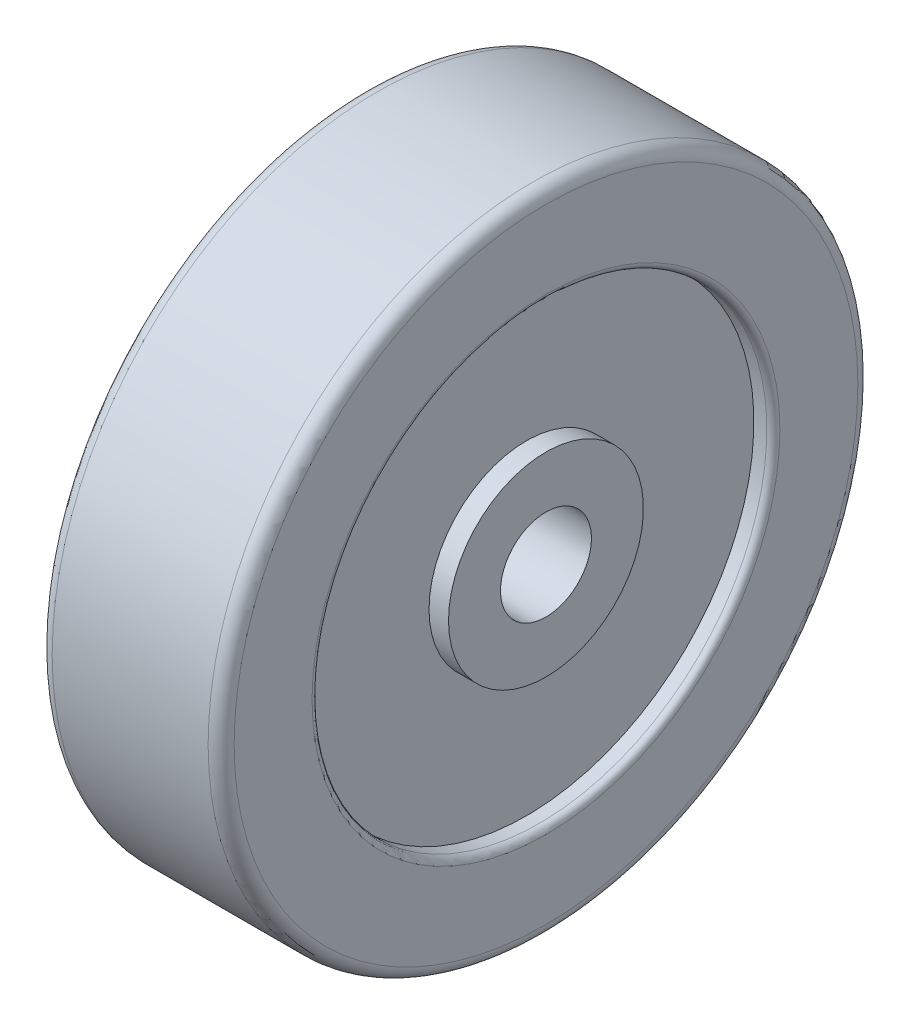
ISO-10303-21;
HEADER;
FILE_DESCRIPTION(('STEP AP214'),'2;1');
FILE_NAME('part.step','',(''),(''),'','','');
FILE_SCHEMA(('AUTOMOTIVE_DESIGN { 1 0 10303 214 1 1 1 1 }'));
ENDSEC;
DATA;
#1=APPLICATION_CONTEXT('core data for automotive mechanical design processes');
#2=APPLICATION_PROTOCOL_DEFINITION('international standard','automotive_design',2000,#1);
#3=PRODUCT_CONTEXT('',#1,'mechanical');
#4=PRODUCT('Part','Part','',(#3));
#5=PRODUCT_RELATED_PRODUCT_CATEGORY('part','',(#4));
#6=PRODUCT_DEFINITION_FORMATION('','',#4);
#7=PRODUCT_DEFINITION_CONTEXT('part definition',#1,'design');
#8=PRODUCT_DEFINITION('design','',#6,#7);
#9=PRODUCT_DEFINITION_SHAPE('','',#8);
#10=(LENGTH_UNIT() NAMED_UNIT(*) SI_UNIT(.MILLI.,.METRE.));
#11=(NAMED_UNIT(*) PLANE_ANGLE_UNIT() SI_UNIT($,.RADIAN.));
#12=(NAMED_UNIT(*) SI_UNIT($,.STERADIAN.) SOLID_ANGLE_UNIT());
#13=UNCERTAINTY_MEASURE_WITH_UNIT(LENGTH_MEASURE(1.E-05),#10,'distance_accuracy_value','');
#14=(GEOMETRIC_REPRESENTATION_CONTEXT(3) GLOBAL_UNCERTAINTY_ASSIGNED_CONTEXT((#13)) GLOBAL_UNIT_ASSIGNED_CONTEXT((#10,
#11,#12)) REPRESENTATION_CONTEXT('',''));
#15=CARTESIAN_POINT('',(0.,0.,0.));
#16=DIRECTION('',(0.,0.,1.));
#17=DIRECTION('',(1.,0.,0.));
#18=AXIS2_PLACEMENT_3D('',#15,#16,#17);
#19=CARTESIAN_POINT('',(-12.6497087523557,8.,0.));
#20=DIRECTION('',(1.,0.,0.));
#21=DIRECTION('',(0.,0.,-1.));
#22=AXIS2_PLACEMENT_3D('',#19,#20,#21);
#23=PLANE('',#22);
#24=CARTESIAN_POINT('',(-12.6497087523557,-7.,0.));
#25=DIRECTION('',(-1.,0.,0.));
#26=DIRECTION('',(0.,0.,1.));
#27=AXIS2_PLACEMENT_3D('',#24,#25,#26);
#28=CIRCLE('',#27,7.);
#29=CARTESIAN_POINT('',(-12.6497087523557,-7.,7.));
#30=VERTEX_POINT('',#29);
#31=EDGE_CURVE('E63',#30,#30,#28,.T.);
#32=ORIENTED_EDGE('',*,*,#31,.F.);
#33=EDGE_LOOP('',(#32));
#34=FACE_BOUND('',#33,.T.);
#35=CARTESIAN_POINT('',(-12.6497087523557,-7.,0.));
#36=DIRECTION('',(-1.,0.,0.));
#37=DIRECTION('',(0.,0.,1.));
#38=AXIS2_PLACEMENT_3D('',#35,#36,#37);
#39=CIRCLE('',#38,15.);
#40=CARTESIAN_POINT('',(-12.6497087523557,-7.,15.));
#41=VERTEX_POINT('',#40);
#42=EDGE_CURVE('E84',#41,#41,#39,.T.);
#43=ORIENTED_EDGE('',*,*,#42,.T.);
#44=EDGE_LOOP('',(#43));
#45=FACE_BOUND('',#44,.T.);
#46=ADVANCED_FACE('F31',(#34,#45),#23,.F.);
#47=CARTESIAN_POINT('',(-30.1636657433056,-7.,0.));
#48=DIRECTION('',(-1.,0.,0.));
#49=DIRECTION('',(0.,0.,1.));
#50=AXIS2_PLACEMENT_3D('',#47,#48,#49);
#51=CYLINDRICAL_SURFACE('',#50,7.);
#52=CARTESIAN_POINT('',(15.3502912476443,-7.,0.));
#53=DIRECTION('',(-1.,0.,0.));
#54=DIRECTION('',(0.,0.,1.));
#55=AXIS2_PLACEMENT_3D('',#52,#53,#54);
#56=CIRCLE('',#55,7.);
#57=CARTESIAN_POINT('',(15.3502912476443,-7.,7.));
#58=VERTEX_POINT('',#57);
#59=EDGE_CURVE('E66',#58,#58,#56,.T.);
#60=ORIENTED_EDGE('',*,*,#59,.F.);
#61=EDGE_LOOP('',(#60));
#62=FACE_BOUND('',#61,.T.);
#63=ORIENTED_EDGE('',*,*,#31,.T.);
#64=EDGE_LOOP('',(#63));
#65=FACE_BOUND('',#64,.T.);
#66=ADVANCED_FACE('F114',(#62,#65),#51,.F.);
#67=CARTESIAN_POINT('',(15.3502912476443,0.,0.));
#68=DIRECTION('',(-1.,0.,0.));
#69=DIRECTION('',(0.,0.,1.));
#70=AXIS2_PLACEMENT_3D('',#67,#68,#69);
#71=PLANE('',#70);
#72=CARTESIAN_POINT('',(15.3502912476443,-7.,0.));
#73=DIRECTION('',(-1.,0.,0.));
#74=DIRECTION('',(0.,0.,1.));
#75=AXIS2_PLACEMENT_3D('',#72,#73,#74);
#76=CIRCLE('',#75,15.);
#77=CARTESIAN_POINT('',(15.3502912476443,-7.,15.));
#78=VERTEX_POINT('',#77);
#79=EDGE_CURVE('E69',#78,#78,#76,.T.);
#80=ORIENTED_EDGE('',*,*,#79,.F.);
#81=EDGE_LOOP('',(#80));
#82=FACE_BOUND('',#81,.T.);
#83=ORIENTED_EDGE('',*,*,#59,.T.);
#84=EDGE_LOOP('',(#83));
#85=FACE_BOUND('',#84,.T.);
#86=ADVANCED_FACE('F120',(#82,#85),#71,.F.);
#87=CARTESIAN_POINT('',(-30.1636657433056,-7.,0.));
#88=DIRECTION('',(-1.,0.,0.));
#89=DIRECTION('',(0.,0.,1.));
#90=AXIS2_PLACEMENT_3D('',#87,#88,#89);
#91=CYLINDRICAL_SURFACE('',#90,15.);
#92=CARTESIAN_POINT('',(12.3502912476443,-7.,0.));
#93=DIRECTION('',(-1.,0.,0.));
#94=DIRECTION('',(0.,0.,1.));
#95=AXIS2_PLACEMENT_3D('',#92,#93,#94);
#96=CIRCLE('',#95,15.);
#97=CARTESIAN_POINT('',(12.3502912476443,-7.,15.));
#98=VERTEX_POINT('',#97);
#99=EDGE_CURVE('E72',#98,#98,#96,.T.);
#100=ORIENTED_EDGE('',*,*,#99,.F.);
#101=EDGE_LOOP('',(#100));
#102=FACE_BOUND('',#101,.T.);
#103=ORIENTED_EDGE('',*,*,#79,.T.);
#104=EDGE_LOOP('',(#103));
#105=FACE_BOUND('',#104,.T.);
#106=ADVANCED_FACE('F223',(#102,#105),#91,.T.);
#107=CARTESIAN_POINT('',(12.3502912476443,8.,0.));
#108=DIRECTION('',(-1.,0.,0.));
#109=DIRECTION('',(0.,0.,1.));
#110=AXIS2_PLACEMENT_3D('',#107,#108,#109);
#111=PLANE('',#110);
#112=CARTESIAN_POINT('',(12.3502912476443,-7.,0.));
#113=DIRECTION('',(-1.,0.,0.));
#114=DIRECTION('',(0.,0.,1.));
#115=AXIS2_PLACEMENT_3D('',#112,#113,#114);
#116=CIRCLE('',#115,35.);
#117=CARTESIAN_POINT('',(12.3502912476443,-7.,35.));
#118=VERTEX_POINT('',#117);
#119=EDGE_CURVE('E75',#118,#118,#116,.T.);
#120=ORIENTED_EDGE('',*,*,#119,.F.);
#121=EDGE_LOOP('',(#120));
#122=FACE_BOUND('',#121,.T.);
#123=ORIENTED_EDGE('',*,*,#99,.T.);
#124=EDGE_LOOP('',(#123));
#125=FACE_BOUND('',#124,.T.);
#126=ADVANCED_FACE('F169',(#122,#125),#111,.F.);
#127=CARTESIAN_POINT('',(-30.1636657433056,-7.,0.));
#128=DIRECTION('',(-1.,0.,0.));
#129=DIRECTION('',(0.,0.,1.));
#130=AXIS2_PLACEMENT_3D('',#127,#128,#129);
#131=CYLINDRICAL_SURFACE('',#130,35.);
#132=CARTESIAN_POINT('',(14.3502912476443,-7.,0.));
#133=DIRECTION('',(-1.,0.,0.));
#134=DIRECTION('',(0.,0.,1.));
#135=AXIS2_PLACEMENT_3D('',#132,#133,#134);
#136=CIRCLE('',#135,35.);
#137=CARTESIAN_POINT('',(14.3502912476443,-7.,35.));
#138=VERTEX_POINT('',#137);
#139=EDGE_CURVE('E10',#138,#138,#136,.F.);
#140=ORIENTED_EDGE('',*,*,#139,.T.);
#141=EDGE_LOOP('',(#140));
#142=FACE_BOUND('',#141,.T.);
#143=ORIENTED_EDGE('',*,*,#119,.T.);
#144=EDGE_LOOP('',(#143));
#145=FACE_BOUND('',#144,.T.);
#146=ADVANCED_FACE('F159',(#142,#145),#131,.F.);
#147=CARTESIAN_POINT('',(15.3502912476443,28.,0.));
#148=DIRECTION('',(-1.,0.,0.));
#149=DIRECTION('',(0.,0.,1.));
#150=AXIS2_PLACEMENT_3D('',#147,#148,#149);
#151=PLANE('',#150);
#152=CARTESIAN_POINT('',(15.3502912476443,-7.,0.));
#153=DIRECTION('',(-1.,0.,0.));
#154=DIRECTION('',(0.,0.,1.));
#155=AXIS2_PLACEMENT_3D('',#152,#153,#154);
#156=CIRCLE('',#155,36.);
#157=CARTESIAN_POINT('',(15.3502912476443,-7.,36.));
#158=VERTEX_POINT('',#157);
#159=EDGE_CURVE('E38',#158,#158,#156,.T.);
#160=ORIENTED_EDGE('',*,*,#159,.T.);
#161=EDGE_LOOP('',(#160));
#162=FACE_BOUND('',#161,.T.);
#163=CARTESIAN_POINT('',(15.3502912476443,-7.,0.));
#164=DIRECTION('',(-1.,0.,0.));
#165=DIRECTION('',(0.,0.,1.));
#166=AXIS2_PLACEMENT_3D('',#163,#164,#165);
#167=CIRCLE('',#166,48.);
#168=CARTESIAN_POINT('',(15.3502912476443,-7.,48.));
#169=VERTEX_POINT('',#168);
#170=EDGE_CURVE('E57',#169,#169,#167,.F.);
#171=ORIENTED_EDGE('',*,*,#170,.T.);
#172=EDGE_LOOP('',(#171));
#173=FACE_BOUND('',#172,.T.);
#174=ADVANCED_FACE('F154',(#162,#173),#151,.F.);
#175=CARTESIAN_POINT('',(-30.1636657433056,-7.,0.));
#176=DIRECTION('',(-1.,0.,0.));
#177=DIRECTION('',(0.,0.,1.));
#178=AXIS2_PLACEMENT_3D('',#175,#176,#177);
#179=CYLINDRICAL_SURFACE('',#178,50.);
#180=CARTESIAN_POINT('',(-10.6497087523557,-7.,0.));
#181=DIRECTION('',(1.,0.,0.));
#182=DIRECTION('',(0.,0.,-1.));
#183=AXIS2_PLACEMENT_3D('',#180,#181,#182);
#184=CIRCLE('',#183,50.);
#185=CARTESIAN_POINT('',(-10.6497087523557,-7.,-50.));
#186=VERTEX_POINT('',#185);
#187=EDGE_CURVE('E51',#186,#186,#184,.T.);
#188=ORIENTED_EDGE('',*,*,#187,.T.);
#189=EDGE_LOOP('',(#188));
#190=FACE_BOUND('',#189,.T.);
#191=CARTESIAN_POINT('',(13.3502912476443,-7.,0.));
#192=DIRECTION('',(-1.,0.,0.));
#193=DIRECTION('',(0.,0.,1.));
#194=AXIS2_PLACEMENT_3D('',#191,#192,#193);
#195=CIRCLE('',#194,50.);
#196=CARTESIAN_POINT('',(13.3502912476443,-7.,50.));
#197=VERTEX_POINT('',#196);
#198=EDGE_CURVE('E60',#197,#197,#195,.T.);
#199=ORIENTED_EDGE('',*,*,#198,.T.);
#200=EDGE_LOOP('',(#199));
#201=FACE_BOUND('',#200,.T.);
#202=ADVANCED_FACE('F110',(#190,#201),#179,.T.);
#203=CARTESIAN_POINT('',(-12.6497087523557,43.,0.));
#204=DIRECTION('',(1.,0.,0.));
#205=DIRECTION('',(0.,0.,-1.));
#206=AXIS2_PLACEMENT_3D('',#203,#204,#205);
#207=PLANE('',#206);
#208=CARTESIAN_POINT('',(-12.6497087523557,-7.,0.));
#209=DIRECTION('',(1.,0.,0.));
#210=DIRECTION('',(0.,0.,-1.));
#211=AXIS2_PLACEMENT_3D('',#208,#209,#210);
#212=CIRCLE('',#211,36.);
#213=CARTESIAN_POINT('',(-12.6497087523557,-7.,-36.));
#214=VERTEX_POINT('',#213);
#215=EDGE_CURVE('E42',#214,#214,#212,.T.);
#216=ORIENTED_EDGE('',*,*,#215,.T.);
#217=EDGE_LOOP('',(#216));
#218=FACE_BOUND('',#217,.T.);
#219=CARTESIAN_POINT('',(-12.6497087523557,-7.,0.));
#220=DIRECTION('',(1.,0.,0.));
#221=DIRECTION('',(0.,0.,-1.));
#222=AXIS2_PLACEMENT_3D('',#219,#220,#221);
#223=CIRCLE('',#222,48.);
#224=CARTESIAN_POINT('',(-12.6497087523557,-7.,-48.));
#225=VERTEX_POINT('',#224);
#226=EDGE_CURVE('E54',#225,#225,#223,.F.);
#227=ORIENTED_EDGE('',*,*,#226,.T.);
#228=EDGE_LOOP('',(#227));
#229=FACE_BOUND('',#228,.T.);
#230=ADVANCED_FACE('F104',(#218,#229),#207,.F.);
#231=CARTESIAN_POINT('',(-30.1636657433056,-7.,0.));
#232=DIRECTION('',(-1.,0.,0.));
#233=DIRECTION('',(0.,0.,1.));
#234=AXIS2_PLACEMENT_3D('',#231,#232,#233);
#235=CYLINDRICAL_SURFACE('',#234,35.);
#236=CARTESIAN_POINT('',(-11.6497087523557,-7.,0.));
#237=DIRECTION('',(1.,0.,0.));
#238=DIRECTION('',(0.,0.,-1.));
#239=AXIS2_PLACEMENT_3D('',#236,#237,#238);
#240=CIRCLE('',#239,35.);
#241=CARTESIAN_POINT('',(-11.6497087523557,-7.,-35.));
#242=VERTEX_POINT('',#241);
#243=EDGE_CURVE('E46',#242,#242,#240,.F.);
#244=ORIENTED_EDGE('',*,*,#243,.T.);
#245=EDGE_LOOP('',(#244));
#246=FACE_BOUND('',#245,.T.);
#247=CARTESIAN_POINT('',(-9.64970875235575,-7.,0.));
#248=DIRECTION('',(-1.,0.,0.));
#249=DIRECTION('',(0.,0.,1.));
#250=AXIS2_PLACEMENT_3D('',#247,#248,#249);
#251=CIRCLE('',#250,35.);
#252=CARTESIAN_POINT('',(-9.64970875235575,-7.,35.));
#253=VERTEX_POINT('',#252);
#254=EDGE_CURVE('E78',#253,#253,#251,.T.);
#255=ORIENTED_EDGE('',*,*,#254,.F.);
#256=EDGE_LOOP('',(#255));
#257=FACE_BOUND('',#256,.T.);
#258=ADVANCED_FACE('F99',(#246,#257),#235,.F.);
#259=CARTESIAN_POINT('',(-9.64970875235575,28.,0.));
#260=DIRECTION('',(1.,0.,0.));
#261=DIRECTION('',(0.,0.,-1.));
#262=AXIS2_PLACEMENT_3D('',#259,#260,#261);
#263=PLANE('',#262);
#264=CARTESIAN_POINT('',(-9.64970875235575,-7.,0.));
#265=DIRECTION('',(-1.,0.,0.));
#266=DIRECTION('',(0.,0.,1.));
#267=AXIS2_PLACEMENT_3D('',#264,#265,#266);
#268=CIRCLE('',#267,15.);
#269=CARTESIAN_POINT('',(-9.64970875235575,-7.,15.));
#270=VERTEX_POINT('',#269);
#271=EDGE_CURVE('E81',#270,#270,#268,.T.);
#272=ORIENTED_EDGE('',*,*,#271,.F.);
#273=EDGE_LOOP('',(#272));
#274=FACE_BOUND('',#273,.T.);
#275=ORIENTED_EDGE('',*,*,#254,.T.);
#276=EDGE_LOOP('',(#275));
#277=FACE_BOUND('',#276,.T.);
#278=ADVANCED_FACE('F93',(#274,#277),#263,.F.);
#279=CARTESIAN_POINT('',(-30.1636657433056,-7.,0.));
#280=DIRECTION('',(-1.,0.,0.));
#281=DIRECTION('',(0.,0.,1.));
#282=AXIS2_PLACEMENT_3D('',#279,#280,#281);
#283=CYLINDRICAL_SURFACE('',#282,15.);
#284=ORIENTED_EDGE('',*,*,#42,.F.);
#285=EDGE_LOOP('',(#284));
#286=FACE_BOUND('',#285,.T.);
#287=ORIENTED_EDGE('',*,*,#271,.T.);
#288=EDGE_LOOP('',(#287));
#289=FACE_BOUND('',#288,.T.);
#290=ADVANCED_FACE('F89',(#286,#289),#283,.T.);
#291=CARTESIAN_POINT('',(13.3502912476443,-7.,0.));
#292=DIRECTION('',(-1.,0.,0.));
#293=DIRECTION('',(0.,0.,1.));
#294=AXIS2_PLACEMENT_3D('',#291,#292,#293);
#295=TOROIDAL_SURFACE('',#294,48.,2.);
#296=ORIENTED_EDGE('',*,*,#170,.F.);
#297=EDGE_LOOP('',(#296));
#298=FACE_BOUND('',#297,.T.);
#299=ORIENTED_EDGE('',*,*,#198,.F.);
#300=EDGE_LOOP('',(#299));
#301=FACE_BOUND('',#300,.T.);
#302=ADVANCED_FACE('F92',(#298,#301),#295,.T.);
#303=CARTESIAN_POINT('',(-10.6497087523557,-7.,0.));
#304=DIRECTION('',(1.,0.,0.));
#305=DIRECTION('',(0.,0.,-1.));
#306=AXIS2_PLACEMENT_3D('',#303,#304,#305);
#307=TOROIDAL_SURFACE('',#306,48.,2.);
#308=ORIENTED_EDGE('',*,*,#187,.F.);
#309=EDGE_LOOP('',(#308));
#310=FACE_BOUND('',#309,.T.);
#311=ORIENTED_EDGE('',*,*,#226,.F.);
#312=EDGE_LOOP('',(#311));
#313=FACE_BOUND('',#312,.T.);
#314=ADVANCED_FACE('F128',(#310,#313),#307,.T.);
#315=CARTESIAN_POINT('',(-11.6497087523557,-7.,0.));
#316=DIRECTION('',(1.,0.,0.));
#317=DIRECTION('',(0.,0.,-1.));
#318=AXIS2_PLACEMENT_3D('',#315,#316,#317);
#319=TOROIDAL_SURFACE('',#318,36.,1.);
#320=ORIENTED_EDGE('',*,*,#215,.F.);
#321=EDGE_LOOP('',(#320));
#322=FACE_BOUND('',#321,.T.);
#323=ORIENTED_EDGE('',*,*,#243,.F.);
#324=EDGE_LOOP('',(#323));
#325=FACE_BOUND('',#324,.T.);
#326=ADVANCED_FACE('F131',(#322,#325),#319,.T.);
#327=CARTESIAN_POINT('',(14.3502912476443,-7.,0.));
#328=DIRECTION('',(-1.,0.,0.));
#329=DIRECTION('',(0.,0.,1.));
#330=AXIS2_PLACEMENT_3D('',#327,#328,#329);
#331=TOROIDAL_SURFACE('',#330,36.,1.);
#332=ORIENTED_EDGE('',*,*,#139,.F.);
#333=EDGE_LOOP('',(#332));
#334=FACE_BOUND('',#333,.T.);
#335=ORIENTED_EDGE('',*,*,#159,.F.);
#336=EDGE_LOOP('',(#335));
#337=FACE_BOUND('',#336,.T.);
#338=ADVANCED_FACE('F33',(#334,#337),#331,.T.);
#339=CLOSED_SHELL('',(#46,#66,#86,#106,#126,#146,#174,#202,#230,#258,#278,#290,#302,#314,#326,#338));
#340=MANIFOLD_SOLID_BREP('B2',#339);
#341=ADVANCED_BREP_SHAPE_REPRESENTATION('',(#18,#340),#14);
#342=SHAPE_DEFINITION_REPRESENTATION(#9,#341);
ENDSEC;
END-ISO-10303-21;
